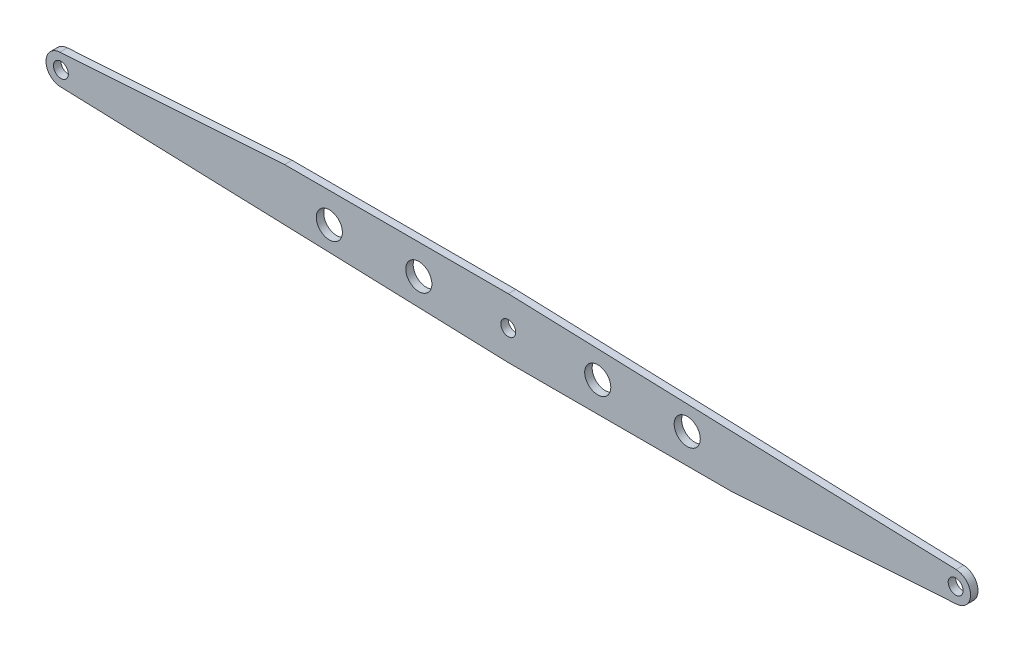
ISO-10303-21;
HEADER;
FILE_DESCRIPTION(('STEP AP214'),'2;1');
FILE_NAME('part.step','',(''),(''),'','','');
FILE_SCHEMA(('AUTOMOTIVE_DESIGN { 1 0 10303 214 1 1 1 1 }'));
ENDSEC;
DATA;
#1=APPLICATION_CONTEXT('core data for automotive mechanical design processes');
#2=APPLICATION_PROTOCOL_DEFINITION('international standard','automotive_design',2000,#1);
#3=PRODUCT_CONTEXT('',#1,'mechanical');
#4=PRODUCT('Part','Part','',(#3));
#5=PRODUCT_RELATED_PRODUCT_CATEGORY('part','',(#4));
#6=PRODUCT_DEFINITION_FORMATION('','',#4);
#7=PRODUCT_DEFINITION_CONTEXT('part definition',#1,'design');
#8=PRODUCT_DEFINITION('design','',#6,#7);
#9=PRODUCT_DEFINITION_SHAPE('','',#8);
#10=(LENGTH_UNIT() NAMED_UNIT(*) SI_UNIT(.MILLI.,.METRE.));
#11=(NAMED_UNIT(*) PLANE_ANGLE_UNIT() SI_UNIT($,.RADIAN.));
#12=(NAMED_UNIT(*) SI_UNIT($,.STERADIAN.) SOLID_ANGLE_UNIT());
#13=UNCERTAINTY_MEASURE_WITH_UNIT(LENGTH_MEASURE(1.E-05),#10,'distance_accuracy_value','');
#14=(GEOMETRIC_REPRESENTATION_CONTEXT(3) GLOBAL_UNCERTAINTY_ASSIGNED_CONTEXT((#13)) GLOBAL_UNIT_ASSIGNED_CONTEXT((#10,
#11,#12)) REPRESENTATION_CONTEXT('',''));
#15=CARTESIAN_POINT('',(0.,0.,0.));
#16=DIRECTION('',(0.,0.,1.));
#17=DIRECTION('',(1.,0.,0.));
#18=AXIS2_PLACEMENT_3D('',#15,#16,#17);
#19=CARTESIAN_POINT('',(-600.,0.,5.));
#20=DIRECTION('',(0.,0.,1.));
#21=DIRECTION('',(1.,0.,0.));
#22=AXIS2_PLACEMENT_3D('',#19,#20,#21);
#23=PLANE('',#22);
#24=CARTESIAN_POINT('',(120.,0.,5.));
#25=DIRECTION('',(0.,0.,1.));
#26=DIRECTION('',(1.,0.,0.));
#27=AXIS2_PLACEMENT_3D('',#24,#25,#26);
#28=CIRCLE('',#27,17.5);
#29=CARTESIAN_POINT('',(137.5,0.,5.));
#30=VERTEX_POINT('',#29);
#31=EDGE_CURVE('E214',#30,#30,#28,.T.);
#32=ORIENTED_EDGE('',*,*,#31,.F.);
#33=EDGE_LOOP('',(#32));
#34=FACE_BOUND('',#33,.T.);
#35=CARTESIAN_POINT('',(-120.,0.,5.));
#36=DIRECTION('',(0.,0.,1.));
#37=DIRECTION('',(1.,0.,0.));
#38=AXIS2_PLACEMENT_3D('',#35,#36,#37);
#39=CIRCLE('',#38,17.5);
#40=CARTESIAN_POINT('',(-102.5,0.,5.));
#41=VERTEX_POINT('',#40);
#42=EDGE_CURVE('E202',#41,#41,#39,.T.);
#43=ORIENTED_EDGE('',*,*,#42,.F.);
#44=EDGE_LOOP('',(#43));
#45=FACE_BOUND('',#44,.T.);
#46=CARTESIAN_POINT('',(600.,0.,5.));
#47=DIRECTION('',(0.,0.,1.));
#48=DIRECTION('',(1.,0.,0.));
#49=AXIS2_PLACEMENT_3D('',#46,#47,#48);
#50=CIRCLE('',#49,9.99999999999998);
#51=CARTESIAN_POINT('',(610.,0.,5.));
#52=VERTEX_POINT('',#51);
#53=EDGE_CURVE('E190',#52,#52,#50,.T.);
#54=ORIENTED_EDGE('',*,*,#53,.F.);
#55=EDGE_LOOP('',(#54));
#56=FACE_BOUND('',#55,.T.);
#57=CARTESIAN_POINT('',(-600.,0.,5.));
#58=DIRECTION('',(0.,0.,1.));
#59=DIRECTION('',(1.,0.,0.));
#60=AXIS2_PLACEMENT_3D('',#57,#58,#59);
#61=CIRCLE('',#60,20.);
#62=CARTESIAN_POINT('',(-601.327453077824,19.9558980836788,5.));
#63=VERTEX_POINT('',#62);
#64=CARTESIAN_POINT('',(-600.665927362948,-19.9889104442257,5.));
#65=VERTEX_POINT('',#64);
#66=EDGE_CURVE('E153',#63,#65,#61,.T.);
#67=ORIENTED_EDGE('',*,*,#66,.T.);
#68=DIRECTION('',(0.999445522211287,-0.0332963681474191,0.));
#69=VECTOR('',#68,1.);
#70=CARTESIAN_POINT('',(0.,-40.,5.));
#71=LINE('',#70,#69);
#72=CARTESIAN_POINT('',(0.,-40.,5.));
#73=VERTEX_POINT('',#72);
#74=EDGE_CURVE('E101',#65,#73,#71,.T.);
#75=ORIENTED_EDGE('',*,*,#74,.T.);
#76=DIRECTION('',(1.,0.,0.));
#77=VECTOR('',#76,1.);
#78=CARTESIAN_POINT('',(0.,-40.,5.));
#79=LINE('',#78,#77);
#80=CARTESIAN_POINT('',(300.,-40.,5.));
#81=VERTEX_POINT('',#80);
#82=EDGE_CURVE('E168',#73,#81,#79,.T.);
#83=ORIENTED_EDGE('',*,*,#82,.T.);
#84=DIRECTION('',(0.997794904183941,0.0663726538911921,0.));
#85=VECTOR('',#84,1.);
#86=CARTESIAN_POINT('',(300.,-40.,5.));
#87=LINE('',#86,#85);
#88=CARTESIAN_POINT('',(601.327453077824,-19.9558980836788,5.));
#89=VERTEX_POINT('',#88);
#90=EDGE_CURVE('E181',#81,#89,#87,.T.);
#91=ORIENTED_EDGE('',*,*,#90,.T.);
#92=CARTESIAN_POINT('',(600.,0.,5.));
#93=DIRECTION('',(0.,0.,1.));
#94=DIRECTION('',(1.,0.,0.));
#95=AXIS2_PLACEMENT_3D('',#92,#93,#94);
#96=CIRCLE('',#95,20.);
#97=CARTESIAN_POINT('',(600.665927362948,19.9889104442257,5.));
#98=VERTEX_POINT('',#97);
#99=EDGE_CURVE('E120',#89,#98,#96,.T.);
#100=ORIENTED_EDGE('',*,*,#99,.T.);
#101=DIRECTION('',(-0.999445522211287,0.0332963681474191,0.));
#102=VECTOR('',#101,1.);
#103=CARTESIAN_POINT('',(0.,40.,5.));
#104=LINE('',#103,#102);
#105=CARTESIAN_POINT('',(0.,40.,5.));
#106=VERTEX_POINT('',#105);
#107=EDGE_CURVE('E114',#98,#106,#104,.T.);
#108=ORIENTED_EDGE('',*,*,#107,.T.);
#109=DIRECTION('',(-1.,0.,0.));
#110=VECTOR('',#109,1.);
#111=CARTESIAN_POINT('',(0.,40.,5.));
#112=LINE('',#111,#110);
#113=CARTESIAN_POINT('',(-300.,40.,5.));
#114=VERTEX_POINT('',#113);
#115=EDGE_CURVE('E118',#106,#114,#112,.T.);
#116=ORIENTED_EDGE('',*,*,#115,.T.);
#117=DIRECTION('',(-0.997794904183941,-0.0663726538911921,0.));
#118=VECTOR('',#117,1.);
#119=CARTESIAN_POINT('',(-300.,40.,5.));
#120=LINE('',#119,#118);
#121=EDGE_CURVE('E58',#114,#63,#120,.T.);
#122=ORIENTED_EDGE('',*,*,#121,.T.);
#123=EDGE_LOOP('',(#67,#75,#83,#91,#100,#108,#116,#122));
#124=FACE_BOUND('',#123,.T.);
#125=CARTESIAN_POINT('',(-600.,0.,5.));
#126=DIRECTION('',(0.,0.,1.));
#127=DIRECTION('',(1.,0.,0.));
#128=AXIS2_PLACEMENT_3D('',#125,#126,#127);
#129=CIRCLE('',#128,9.99999999999998);
#130=CARTESIAN_POINT('',(-590.,0.,5.));
#131=VERTEX_POINT('',#130);
#132=EDGE_CURVE('E142',#131,#131,#129,.T.);
#133=ORIENTED_EDGE('',*,*,#132,.F.);
#134=EDGE_LOOP('',(#133));
#135=FACE_BOUND('',#134,.T.);
#136=CARTESIAN_POINT('',(0.,0.,5.));
#137=DIRECTION('',(0.,0.,1.));
#138=DIRECTION('',(1.,0.,0.));
#139=AXIS2_PLACEMENT_3D('',#136,#137,#138);
#140=CIRCLE('',#139,10.);
#141=CARTESIAN_POINT('',(10.,0.,5.));
#142=VERTEX_POINT('',#141);
#143=EDGE_CURVE('E196',#142,#142,#140,.T.);
#144=ORIENTED_EDGE('',*,*,#143,.F.);
#145=EDGE_LOOP('',(#144));
#146=FACE_BOUND('',#145,.T.);
#147=CARTESIAN_POINT('',(-240.,-8.37955521322352E-13,5.));
#148=DIRECTION('',(0.,0.,1.));
#149=DIRECTION('',(1.,0.,0.));
#150=AXIS2_PLACEMENT_3D('',#147,#148,#149);
#151=CIRCLE('',#150,17.5);
#152=CARTESIAN_POINT('',(-222.5,-8.37955521322352E-13,5.));
#153=VERTEX_POINT('',#152);
#154=EDGE_CURVE('E208',#153,#153,#151,.T.);
#155=ORIENTED_EDGE('',*,*,#154,.F.);
#156=EDGE_LOOP('',(#155));
#157=FACE_BOUND('',#156,.T.);
#158=CARTESIAN_POINT('',(240.,0.,5.));
#159=DIRECTION('',(0.,0.,1.));
#160=DIRECTION('',(1.,0.,0.));
#161=AXIS2_PLACEMENT_3D('',#158,#159,#160);
#162=CIRCLE('',#161,17.5);
#163=CARTESIAN_POINT('',(257.5,0.,5.));
#164=VERTEX_POINT('',#163);
#165=EDGE_CURVE('E220',#164,#164,#162,.T.);
#166=ORIENTED_EDGE('',*,*,#165,.F.);
#167=EDGE_LOOP('',(#166));
#168=FACE_BOUND('',#167,.T.);
#169=ADVANCED_FACE('F41',(#34,#45,#56,#124,#135,#146,#157,#168),#23,.T.);
#170=CARTESIAN_POINT('',(-600.,0.,-5.));
#171=DIRECTION('',(0.,0.,1.));
#172=DIRECTION('',(1.,0.,0.));
#173=AXIS2_PLACEMENT_3D('',#170,#171,#172);
#174=PLANE('',#173);
#175=CARTESIAN_POINT('',(-600.,0.,-5.));
#176=DIRECTION('',(0.,0.,1.));
#177=DIRECTION('',(1.,0.,0.));
#178=AXIS2_PLACEMENT_3D('',#175,#176,#177);
#179=CIRCLE('',#178,20.);
#180=CARTESIAN_POINT('',(-601.327453077824,19.9558980836788,-5.));
#181=VERTEX_POINT('',#180);
#182=CARTESIAN_POINT('',(-600.665927362948,-19.9889104442257,-5.));
#183=VERTEX_POINT('',#182);
#184=EDGE_CURVE('E138',#181,#183,#179,.T.);
#185=ORIENTED_EDGE('',*,*,#184,.F.);
#186=DIRECTION('',(-0.997794904183941,-0.0663726538911921,0.));
#187=VECTOR('',#186,1.);
#188=CARTESIAN_POINT('',(-300.,40.,-5.));
#189=LINE('',#188,#187);
#190=CARTESIAN_POINT('',(-300.,40.,-5.));
#191=VERTEX_POINT('',#190);
#192=EDGE_CURVE('E93',#191,#181,#189,.T.);
#193=ORIENTED_EDGE('',*,*,#192,.F.);
#194=DIRECTION('',(-1.,0.,0.));
#195=VECTOR('',#194,1.);
#196=CARTESIAN_POINT('',(0.,40.,-5.));
#197=LINE('',#196,#195);
#198=CARTESIAN_POINT('',(0.,40.,-5.));
#199=VERTEX_POINT('',#198);
#200=EDGE_CURVE('E87',#199,#191,#197,.T.);
#201=ORIENTED_EDGE('',*,*,#200,.F.);
#202=DIRECTION('',(-0.999445522211287,0.0332963681474191,0.));
#203=VECTOR('',#202,1.);
#204=CARTESIAN_POINT('',(0.,40.,-5.));
#205=LINE('',#204,#203);
#206=CARTESIAN_POINT('',(600.665927362948,19.9889104442257,-5.));
#207=VERTEX_POINT('',#206);
#208=EDGE_CURVE('E128',#207,#199,#205,.T.);
#209=ORIENTED_EDGE('',*,*,#208,.F.);
#210=CARTESIAN_POINT('',(600.,0.,-5.));
#211=DIRECTION('',(0.,0.,1.));
#212=DIRECTION('',(1.,0.,0.));
#213=AXIS2_PLACEMENT_3D('',#210,#211,#212);
#214=CIRCLE('',#213,20.);
#215=CARTESIAN_POINT('',(601.327453077824,-19.9558980836788,-5.));
#216=VERTEX_POINT('',#215);
#217=EDGE_CURVE('E148',#216,#207,#214,.T.);
#218=ORIENTED_EDGE('',*,*,#217,.F.);
#219=DIRECTION('',(0.997794904183941,0.0663726538911921,0.));
#220=VECTOR('',#219,1.);
#221=CARTESIAN_POINT('',(300.,-40.,-5.));
#222=LINE('',#221,#220);
#223=CARTESIAN_POINT('',(300.,-40.,-5.));
#224=VERTEX_POINT('',#223);
#225=EDGE_CURVE('E146',#224,#216,#222,.T.);
#226=ORIENTED_EDGE('',*,*,#225,.F.);
#227=DIRECTION('',(1.,0.,0.));
#228=VECTOR('',#227,1.);
#229=CARTESIAN_POINT('',(0.,-40.,-5.));
#230=LINE('',#229,#228);
#231=CARTESIAN_POINT('',(0.,-40.,-5.));
#232=VERTEX_POINT('',#231);
#233=EDGE_CURVE('E144',#232,#224,#230,.T.);
#234=ORIENTED_EDGE('',*,*,#233,.F.);
#235=DIRECTION('',(0.999445522211287,-0.0332963681474191,0.));
#236=VECTOR('',#235,1.);
#237=CARTESIAN_POINT('',(0.,-40.,-5.));
#238=LINE('',#237,#236);
#239=EDGE_CURVE('E141',#183,#232,#238,.T.);
#240=ORIENTED_EDGE('',*,*,#239,.F.);
#241=EDGE_LOOP('',(#185,#193,#201,#209,#218,#226,#234,#240));
#242=FACE_BOUND('',#241,.T.);
#243=CARTESIAN_POINT('',(-600.,0.,-5.));
#244=DIRECTION('',(0.,0.,1.));
#245=DIRECTION('',(1.,0.,0.));
#246=AXIS2_PLACEMENT_3D('',#243,#244,#245);
#247=CIRCLE('',#246,9.99999999999998);
#248=CARTESIAN_POINT('',(-590.,0.,-5.));
#249=VERTEX_POINT('',#248);
#250=EDGE_CURVE('E187',#249,#249,#247,.T.);
#251=ORIENTED_EDGE('',*,*,#250,.T.);
#252=EDGE_LOOP('',(#251));
#253=FACE_BOUND('',#252,.T.);
#254=CARTESIAN_POINT('',(600.,0.,-5.));
#255=DIRECTION('',(0.,0.,1.));
#256=DIRECTION('',(1.,0.,0.));
#257=AXIS2_PLACEMENT_3D('',#254,#255,#256);
#258=CIRCLE('',#257,9.99999999999998);
#259=CARTESIAN_POINT('',(610.,0.,-5.));
#260=VERTEX_POINT('',#259);
#261=EDGE_CURVE('E193',#260,#260,#258,.T.);
#262=ORIENTED_EDGE('',*,*,#261,.T.);
#263=EDGE_LOOP('',(#262));
#264=FACE_BOUND('',#263,.T.);
#265=CARTESIAN_POINT('',(0.,0.,-5.));
#266=DIRECTION('',(0.,0.,1.));
#267=DIRECTION('',(1.,0.,0.));
#268=AXIS2_PLACEMENT_3D('',#265,#266,#267);
#269=CIRCLE('',#268,10.);
#270=CARTESIAN_POINT('',(10.,0.,-5.));
#271=VERTEX_POINT('',#270);
#272=EDGE_CURVE('E199',#271,#271,#269,.T.);
#273=ORIENTED_EDGE('',*,*,#272,.T.);
#274=EDGE_LOOP('',(#273));
#275=FACE_BOUND('',#274,.T.);
#276=CARTESIAN_POINT('',(-120.,0.,-5.));
#277=DIRECTION('',(0.,0.,1.));
#278=DIRECTION('',(1.,0.,0.));
#279=AXIS2_PLACEMENT_3D('',#276,#277,#278);
#280=CIRCLE('',#279,17.5);
#281=CARTESIAN_POINT('',(-102.5,0.,-5.));
#282=VERTEX_POINT('',#281);
#283=EDGE_CURVE('E205',#282,#282,#280,.T.);
#284=ORIENTED_EDGE('',*,*,#283,.T.);
#285=EDGE_LOOP('',(#284));
#286=FACE_BOUND('',#285,.T.);
#287=CARTESIAN_POINT('',(-240.,-8.37955521322352E-13,-5.));
#288=DIRECTION('',(0.,0.,1.));
#289=DIRECTION('',(1.,0.,0.));
#290=AXIS2_PLACEMENT_3D('',#287,#288,#289);
#291=CIRCLE('',#290,17.5);
#292=CARTESIAN_POINT('',(-222.5,-8.37955521322352E-13,-5.));
#293=VERTEX_POINT('',#292);
#294=EDGE_CURVE('E211',#293,#293,#291,.T.);
#295=ORIENTED_EDGE('',*,*,#294,.T.);
#296=EDGE_LOOP('',(#295));
#297=FACE_BOUND('',#296,.T.);
#298=CARTESIAN_POINT('',(120.,0.,-5.));
#299=DIRECTION('',(0.,0.,1.));
#300=DIRECTION('',(1.,0.,0.));
#301=AXIS2_PLACEMENT_3D('',#298,#299,#300);
#302=CIRCLE('',#301,17.5);
#303=CARTESIAN_POINT('',(137.5,0.,-5.));
#304=VERTEX_POINT('',#303);
#305=EDGE_CURVE('E217',#304,#304,#302,.T.);
#306=ORIENTED_EDGE('',*,*,#305,.T.);
#307=EDGE_LOOP('',(#306));
#308=FACE_BOUND('',#307,.T.);
#309=CARTESIAN_POINT('',(240.,0.,-5.));
#310=DIRECTION('',(0.,0.,1.));
#311=DIRECTION('',(1.,0.,0.));
#312=AXIS2_PLACEMENT_3D('',#309,#310,#311);
#313=CIRCLE('',#312,17.5);
#314=CARTESIAN_POINT('',(257.5,0.,-5.));
#315=VERTEX_POINT('',#314);
#316=EDGE_CURVE('E223',#315,#315,#313,.T.);
#317=ORIENTED_EDGE('',*,*,#316,.T.);
#318=EDGE_LOOP('',(#317));
#319=FACE_BOUND('',#318,.T.);
#320=ADVANCED_FACE('F172',(#242,#253,#264,#275,#286,#297,#308,#319),#174,.F.);
#321=CARTESIAN_POINT('',(-600.,0.,5.));
#322=DIRECTION('',(0.,0.,-1.));
#323=DIRECTION('',(-1.,0.,0.));
#324=AXIS2_PLACEMENT_3D('',#321,#322,#323);
#325=CYLINDRICAL_SURFACE('',#324,20.);
#326=ORIENTED_EDGE('',*,*,#184,.T.);
#327=DIRECTION('',(0.,0.,-1.));
#328=VECTOR('',#327,1.);
#329=CARTESIAN_POINT('',(-600.665927362948,-19.9889104442257,5.));
#330=LINE('',#329,#328);
#331=EDGE_CURVE('E11',#65,#183,#330,.T.);
#332=ORIENTED_EDGE('',*,*,#331,.F.);
#333=ORIENTED_EDGE('',*,*,#66,.F.);
#334=DIRECTION('',(0.,0.,-1.));
#335=VECTOR('',#334,1.);
#336=CARTESIAN_POINT('',(-601.327453077824,19.9558980836788,5.));
#337=LINE('',#336,#335);
#338=EDGE_CURVE('E134',#63,#181,#337,.T.);
#339=ORIENTED_EDGE('',*,*,#338,.T.);
#340=EDGE_LOOP('',(#326,#332,#333,#339));
#341=FACE_BOUND('',#340,.T.);
#342=ADVANCED_FACE('F43',(#341),#325,.T.);
#343=CARTESIAN_POINT('',(0.,-40.,5.));
#344=DIRECTION('',(0.0332963681474191,0.999445522211287,0.));
#345=DIRECTION('',(-0.999445522211287,0.0332963681474191,0.));
#346=AXIS2_PLACEMENT_3D('',#343,#344,#345);
#347=PLANE('',#346);
#348=ORIENTED_EDGE('',*,*,#239,.T.);
#349=DIRECTION('',(0.,0.,-1.));
#350=VECTOR('',#349,1.);
#351=CARTESIAN_POINT('',(0.,-40.,5.));
#352=LINE('',#351,#350);
#353=EDGE_CURVE('E50',#73,#232,#352,.T.);
#354=ORIENTED_EDGE('',*,*,#353,.F.);
#355=ORIENTED_EDGE('',*,*,#74,.F.);
#356=ORIENTED_EDGE('',*,*,#331,.T.);
#357=EDGE_LOOP('',(#348,#354,#355,#356));
#358=FACE_BOUND('',#357,.T.);
#359=ADVANCED_FACE('F257',(#358),#347,.F.);
#360=CARTESIAN_POINT('',(0.,-40.,5.));
#361=DIRECTION('',(0.,1.,0.));
#362=DIRECTION('',(0.,0.,1.));
#363=AXIS2_PLACEMENT_3D('',#360,#361,#362);
#364=PLANE('',#363);
#365=ORIENTED_EDGE('',*,*,#233,.T.);
#366=DIRECTION('',(0.,0.,-1.));
#367=VECTOR('',#366,1.);
#368=CARTESIAN_POINT('',(300.,-40.,5.));
#369=LINE('',#368,#367);
#370=EDGE_CURVE('E160',#81,#224,#369,.T.);
#371=ORIENTED_EDGE('',*,*,#370,.F.);
#372=ORIENTED_EDGE('',*,*,#82,.F.);
#373=ORIENTED_EDGE('',*,*,#353,.T.);
#374=EDGE_LOOP('',(#365,#371,#372,#373));
#375=FACE_BOUND('',#374,.T.);
#376=ADVANCED_FACE('F166',(#375),#364,.F.);
#377=CARTESIAN_POINT('',(300.,-40.,5.));
#378=DIRECTION('',(-0.0663726538911921,0.997794904183941,0.));
#379=DIRECTION('',(-0.997794904183941,-0.0663726538911921,0.));
#380=AXIS2_PLACEMENT_3D('',#377,#378,#379);
#381=PLANE('',#380);
#382=ORIENTED_EDGE('',*,*,#225,.T.);
#383=DIRECTION('',(0.,0.,-1.));
#384=VECTOR('',#383,1.);
#385=CARTESIAN_POINT('',(601.327453077824,-19.9558980836788,5.));
#386=LINE('',#385,#384);
#387=EDGE_CURVE('E157',#89,#216,#386,.T.);
#388=ORIENTED_EDGE('',*,*,#387,.F.);
#389=ORIENTED_EDGE('',*,*,#90,.F.);
#390=ORIENTED_EDGE('',*,*,#370,.T.);
#391=EDGE_LOOP('',(#382,#388,#389,#390));
#392=FACE_BOUND('',#391,.T.);
#393=ADVANCED_FACE('F177',(#392),#381,.F.);
#394=CARTESIAN_POINT('',(600.,0.,5.));
#395=DIRECTION('',(0.,0.,-1.));
#396=DIRECTION('',(-1.,0.,0.));
#397=AXIS2_PLACEMENT_3D('',#394,#395,#396);
#398=CYLINDRICAL_SURFACE('',#397,20.);
#399=ORIENTED_EDGE('',*,*,#217,.T.);
#400=DIRECTION('',(0.,0.,-1.));
#401=VECTOR('',#400,1.);
#402=CARTESIAN_POINT('',(600.665927362948,19.9889104442257,5.));
#403=LINE('',#402,#401);
#404=EDGE_CURVE('E129',#98,#207,#403,.T.);
#405=ORIENTED_EDGE('',*,*,#404,.F.);
#406=ORIENTED_EDGE('',*,*,#99,.F.);
#407=ORIENTED_EDGE('',*,*,#387,.T.);
#408=EDGE_LOOP('',(#399,#405,#406,#407));
#409=FACE_BOUND('',#408,.T.);
#410=ADVANCED_FACE('F180',(#409),#398,.T.);
#411=CARTESIAN_POINT('',(0.,40.,5.));
#412=DIRECTION('',(-0.0332963681474191,-0.999445522211287,0.));
#413=DIRECTION('',(0.999445522211287,-0.0332963681474191,0.));
#414=AXIS2_PLACEMENT_3D('',#411,#412,#413);
#415=PLANE('',#414);
#416=ORIENTED_EDGE('',*,*,#208,.T.);
#417=DIRECTION('',(0.,0.,-1.));
#418=VECTOR('',#417,1.);
#419=CARTESIAN_POINT('',(0.,40.,5.));
#420=LINE('',#419,#418);
#421=EDGE_CURVE('E125',#106,#199,#420,.T.);
#422=ORIENTED_EDGE('',*,*,#421,.F.);
#423=ORIENTED_EDGE('',*,*,#107,.F.);
#424=ORIENTED_EDGE('',*,*,#404,.T.);
#425=EDGE_LOOP('',(#416,#422,#423,#424));
#426=FACE_BOUND('',#425,.T.);
#427=ADVANCED_FACE('F126',(#426),#415,.F.);
#428=CARTESIAN_POINT('',(0.,40.,5.));
#429=DIRECTION('',(0.,-1.,0.));
#430=DIRECTION('',(1.,0.,0.));
#431=AXIS2_PLACEMENT_3D('',#428,#429,#430);
#432=PLANE('',#431);
#433=ORIENTED_EDGE('',*,*,#200,.T.);
#434=DIRECTION('',(0.,0.,-1.));
#435=VECTOR('',#434,1.);
#436=CARTESIAN_POINT('',(-300.,40.,5.));
#437=LINE('',#436,#435);
#438=EDGE_CURVE('E130',#114,#191,#437,.T.);
#439=ORIENTED_EDGE('',*,*,#438,.F.);
#440=ORIENTED_EDGE('',*,*,#115,.F.);
#441=ORIENTED_EDGE('',*,*,#421,.T.);
#442=EDGE_LOOP('',(#433,#439,#440,#441));
#443=FACE_BOUND('',#442,.T.);
#444=ADVANCED_FACE('F132',(#443),#432,.F.);
#445=CARTESIAN_POINT('',(-300.,40.,5.));
#446=DIRECTION('',(0.0663726538911921,-0.997794904183941,0.));
#447=DIRECTION('',(0.997794904183941,0.0663726538911921,0.));
#448=AXIS2_PLACEMENT_3D('',#445,#446,#447);
#449=PLANE('',#448);
#450=ORIENTED_EDGE('',*,*,#192,.T.);
#451=ORIENTED_EDGE('',*,*,#338,.F.);
#452=ORIENTED_EDGE('',*,*,#121,.F.);
#453=ORIENTED_EDGE('',*,*,#438,.T.);
#454=EDGE_LOOP('',(#450,#451,#452,#453));
#455=FACE_BOUND('',#454,.T.);
#456=ADVANCED_FACE('F245',(#455),#449,.F.);
#457=CARTESIAN_POINT('',(-600.,0.,5.));
#458=DIRECTION('',(0.,0.,-1.));
#459=DIRECTION('',(-1.,0.,0.));
#460=AXIS2_PLACEMENT_3D('',#457,#458,#459);
#461=CYLINDRICAL_SURFACE('',#460,9.99999999999998);
#462=ORIENTED_EDGE('',*,*,#132,.T.);
#463=EDGE_LOOP('',(#462));
#464=FACE_BOUND('',#463,.T.);
#465=ORIENTED_EDGE('',*,*,#250,.F.);
#466=EDGE_LOOP('',(#465));
#467=FACE_BOUND('',#466,.T.);
#468=ADVANCED_FACE('F242',(#464,#467),#461,.F.);
#469=CARTESIAN_POINT('',(600.,0.,5.));
#470=DIRECTION('',(0.,0.,-1.));
#471=DIRECTION('',(-1.,0.,0.));
#472=AXIS2_PLACEMENT_3D('',#469,#470,#471);
#473=CYLINDRICAL_SURFACE('',#472,9.99999999999998);
#474=ORIENTED_EDGE('',*,*,#53,.T.);
#475=EDGE_LOOP('',(#474));
#476=FACE_BOUND('',#475,.T.);
#477=ORIENTED_EDGE('',*,*,#261,.F.);
#478=EDGE_LOOP('',(#477));
#479=FACE_BOUND('',#478,.T.);
#480=ADVANCED_FACE('F321',(#476,#479),#473,.F.);
#481=CARTESIAN_POINT('',(0.,0.,5.));
#482=DIRECTION('',(0.,0.,-1.));
#483=DIRECTION('',(-1.,0.,0.));
#484=AXIS2_PLACEMENT_3D('',#481,#482,#483);
#485=CYLINDRICAL_SURFACE('',#484,10.);
#486=ORIENTED_EDGE('',*,*,#143,.T.);
#487=EDGE_LOOP('',(#486));
#488=FACE_BOUND('',#487,.T.);
#489=ORIENTED_EDGE('',*,*,#272,.F.);
#490=EDGE_LOOP('',(#489));
#491=FACE_BOUND('',#490,.T.);
#492=ADVANCED_FACE('F329',(#488,#491),#485,.F.);
#493=CARTESIAN_POINT('',(-120.,0.,5.));
#494=DIRECTION('',(0.,0.,-1.));
#495=DIRECTION('',(-1.,0.,0.));
#496=AXIS2_PLACEMENT_3D('',#493,#494,#495);
#497=CYLINDRICAL_SURFACE('',#496,17.5);
#498=ORIENTED_EDGE('',*,*,#42,.T.);
#499=EDGE_LOOP('',(#498));
#500=FACE_BOUND('',#499,.T.);
#501=ORIENTED_EDGE('',*,*,#283,.F.);
#502=EDGE_LOOP('',(#501));
#503=FACE_BOUND('',#502,.T.);
#504=ADVANCED_FACE('F337',(#500,#503),#497,.F.);
#505=CARTESIAN_POINT('',(-240.,-8.37955521322352E-13,5.));
#506=DIRECTION('',(0.,0.,-1.));
#507=DIRECTION('',(-1.,0.,0.));
#508=AXIS2_PLACEMENT_3D('',#505,#506,#507);
#509=CYLINDRICAL_SURFACE('',#508,17.5);
#510=ORIENTED_EDGE('',*,*,#154,.T.);
#511=EDGE_LOOP('',(#510));
#512=FACE_BOUND('',#511,.T.);
#513=ORIENTED_EDGE('',*,*,#294,.F.);
#514=EDGE_LOOP('',(#513));
#515=FACE_BOUND('',#514,.T.);
#516=ADVANCED_FACE('F346',(#512,#515),#509,.F.);
#517=CARTESIAN_POINT('',(120.,0.,5.));
#518=DIRECTION('',(0.,0.,-1.));
#519=DIRECTION('',(-1.,0.,0.));
#520=AXIS2_PLACEMENT_3D('',#517,#518,#519);
#521=CYLINDRICAL_SURFACE('',#520,17.5);
#522=ORIENTED_EDGE('',*,*,#31,.T.);
#523=EDGE_LOOP('',(#522));
#524=FACE_BOUND('',#523,.T.);
#525=ORIENTED_EDGE('',*,*,#305,.F.);
#526=EDGE_LOOP('',(#525));
#527=FACE_BOUND('',#526,.T.);
#528=ADVANCED_FACE('F355',(#524,#527),#521,.F.);
#529=CARTESIAN_POINT('',(240.,0.,5.));
#530=DIRECTION('',(0.,0.,-1.));
#531=DIRECTION('',(-1.,0.,0.));
#532=AXIS2_PLACEMENT_3D('',#529,#530,#531);
#533=CYLINDRICAL_SURFACE('',#532,17.5);
#534=ORIENTED_EDGE('',*,*,#165,.T.);
#535=EDGE_LOOP('',(#534));
#536=FACE_BOUND('',#535,.T.);
#537=ORIENTED_EDGE('',*,*,#316,.F.);
#538=EDGE_LOOP('',(#537));
#539=FACE_BOUND('',#538,.T.);
#540=ADVANCED_FACE('F229',(#536,#539),#533,.F.);
#541=CLOSED_SHELL('',(#169,#320,#342,#359,#376,#393,#410,#427,#444,#456,#468,#480,#492,#504,
#516,#528,#540));
#542=MANIFOLD_SOLID_BREP('B2',#541);
#543=ADVANCED_BREP_SHAPE_REPRESENTATION('',(#18,#542),#14);
#544=SHAPE_DEFINITION_REPRESENTATION(#9,#543);
ENDSEC;
END-ISO-10303-21;
